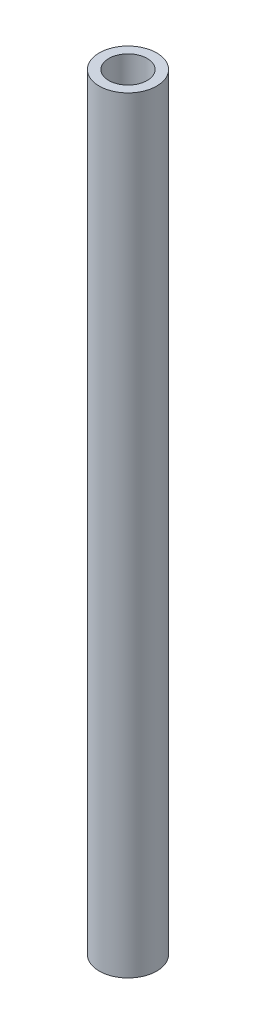
ISO-10303-21;
HEADER;
FILE_DESCRIPTION(('STEP AP214'),'2;1');
FILE_NAME('part.step','',(''),(''),'','','');
FILE_SCHEMA(('AUTOMOTIVE_DESIGN { 1 0 10303 214 1 1 1 1 }'));
ENDSEC;
DATA;
#1=APPLICATION_CONTEXT('core data for automotive mechanical design processes');
#2=APPLICATION_PROTOCOL_DEFINITION('international standard','automotive_design',2000,#1);
#3=PRODUCT_CONTEXT('',#1,'mechanical');
#4=PRODUCT('Part','Part','',(#3));
#5=PRODUCT_RELATED_PRODUCT_CATEGORY('part','',(#4));
#6=PRODUCT_DEFINITION_FORMATION('','',#4);
#7=PRODUCT_DEFINITION_CONTEXT('part definition',#1,'design');
#8=PRODUCT_DEFINITION('design','',#6,#7);
#9=PRODUCT_DEFINITION_SHAPE('','',#8);
#10=(LENGTH_UNIT() NAMED_UNIT(*) SI_UNIT(.MILLI.,.METRE.));
#11=(NAMED_UNIT(*) PLANE_ANGLE_UNIT() SI_UNIT($,.RADIAN.));
#12=(NAMED_UNIT(*) SI_UNIT($,.STERADIAN.) SOLID_ANGLE_UNIT());
#13=UNCERTAINTY_MEASURE_WITH_UNIT(LENGTH_MEASURE(1.E-05),#10,'distance_accuracy_value','');
#14=(GEOMETRIC_REPRESENTATION_CONTEXT(3) GLOBAL_UNCERTAINTY_ASSIGNED_CONTEXT((#13)) GLOBAL_UNIT_ASSIGNED_CONTEXT((#10,
#11,#12)) REPRESENTATION_CONTEXT('',''));
#15=CARTESIAN_POINT('',(0.,0.,0.));
#16=DIRECTION('',(0.,0.,1.));
#17=DIRECTION('',(1.,0.,0.));
#18=AXIS2_PLACEMENT_3D('',#15,#16,#17);
#19=CARTESIAN_POINT('',(0.,400.,0.));
#20=DIRECTION('',(0.,1.,0.));
#21=DIRECTION('',(0.,0.,1.));
#22=AXIS2_PLACEMENT_3D('',#19,#20,#21);
#23=PLANE('',#22);
#24=CARTESIAN_POINT('',(0.,400.,0.));
#25=DIRECTION('',(0.,1.,0.));
#26=DIRECTION('',(0.,0.,1.));
#27=AXIS2_PLACEMENT_3D('',#24,#25,#26);
#28=CIRCLE('',#27,15.);
#29=CARTESIAN_POINT('',(0.,400.,15.));
#30=VERTEX_POINT('',#29);
#31=EDGE_CURVE('E10',#30,#30,#28,.T.);
#32=ORIENTED_EDGE('',*,*,#31,.T.);
#33=EDGE_LOOP('',(#32));
#34=FACE_BOUND('',#33,.T.);
#35=CARTESIAN_POINT('',(0.,400.,0.));
#36=DIRECTION('',(0.,1.,0.));
#37=DIRECTION('',(0.,0.,1.));
#38=AXIS2_PLACEMENT_3D('',#35,#36,#37);
#39=CIRCLE('',#38,10.);
#40=CARTESIAN_POINT('',(0.,400.,10.));
#41=VERTEX_POINT('',#40);
#42=EDGE_CURVE('E41',#41,#41,#39,.T.);
#43=ORIENTED_EDGE('',*,*,#42,.F.);
#44=EDGE_LOOP('',(#43));
#45=FACE_BOUND('',#44,.T.);
#46=ADVANCED_FACE('F30',(#34,#45),#23,.T.);
#47=CARTESIAN_POINT('',(0.,0.,0.));
#48=DIRECTION('',(0.,1.,0.));
#49=DIRECTION('',(0.,0.,1.));
#50=AXIS2_PLACEMENT_3D('',#47,#48,#49);
#51=PLANE('',#50);
#52=CARTESIAN_POINT('',(0.,0.,0.));
#53=DIRECTION('',(0.,1.,0.));
#54=DIRECTION('',(0.,0.,1.));
#55=AXIS2_PLACEMENT_3D('',#52,#53,#54);
#56=CIRCLE('',#55,15.);
#57=CARTESIAN_POINT('',(0.,0.,15.));
#58=VERTEX_POINT('',#57);
#59=EDGE_CURVE('E34',#58,#58,#56,.T.);
#60=ORIENTED_EDGE('',*,*,#59,.F.);
#61=EDGE_LOOP('',(#60));
#62=FACE_BOUND('',#61,.T.);
#63=CARTESIAN_POINT('',(0.,0.,0.));
#64=DIRECTION('',(0.,1.,0.));
#65=DIRECTION('',(0.,0.,1.));
#66=AXIS2_PLACEMENT_3D('',#63,#64,#65);
#67=CIRCLE('',#66,10.);
#68=CARTESIAN_POINT('',(0.,0.,10.));
#69=VERTEX_POINT('',#68);
#70=EDGE_CURVE('E43',#69,#69,#67,.T.);
#71=ORIENTED_EDGE('',*,*,#70,.T.);
#72=EDGE_LOOP('',(#71));
#73=FACE_BOUND('',#72,.T.);
#74=ADVANCED_FACE('F53',(#62,#73),#51,.F.);
#75=CARTESIAN_POINT('',(0.,400.,0.));
#76=DIRECTION('',(0.,-1.,0.));
#77=DIRECTION('',(0.,0.,-1.));
#78=AXIS2_PLACEMENT_3D('',#75,#76,#77);
#79=CYLINDRICAL_SURFACE('',#78,15.);
#80=ORIENTED_EDGE('',*,*,#31,.F.);
#81=EDGE_LOOP('',(#80));
#82=FACE_BOUND('',#81,.T.);
#83=ORIENTED_EDGE('',*,*,#59,.T.);
#84=EDGE_LOOP('',(#83));
#85=FACE_BOUND('',#84,.T.);
#86=ADVANCED_FACE('F32',(#82,#85),#79,.T.);
#87=CARTESIAN_POINT('',(0.,400.,0.));
#88=DIRECTION('',(0.,-1.,0.));
#89=DIRECTION('',(0.,0.,-1.));
#90=AXIS2_PLACEMENT_3D('',#87,#88,#89);
#91=CYLINDRICAL_SURFACE('',#90,10.);
#92=ORIENTED_EDGE('',*,*,#42,.T.);
#93=EDGE_LOOP('',(#92));
#94=FACE_BOUND('',#93,.T.);
#95=ORIENTED_EDGE('',*,*,#70,.F.);
#96=EDGE_LOOP('',(#95));
#97=FACE_BOUND('',#96,.T.);
#98=ADVANCED_FACE('F49',(#94,#97),#91,.F.);
#99=CLOSED_SHELL('',(#46,#74,#86,#98));
#100=MANIFOLD_SOLID_BREP('B2',#99);
#101=ADVANCED_BREP_SHAPE_REPRESENTATION('',(#18,#100),#14);
#102=SHAPE_DEFINITION_REPRESENTATION(#9,#101);
ENDSEC;
END-ISO-10303-21;
